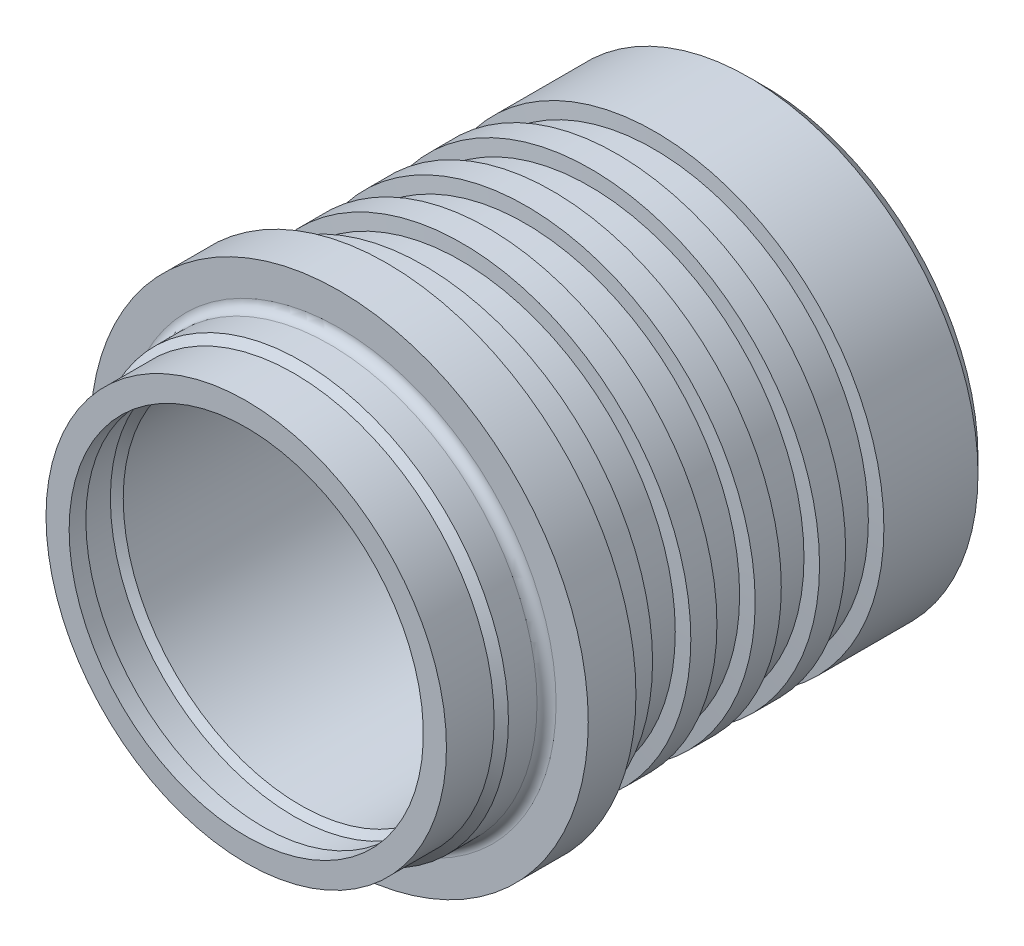
ISO-10303-21;
HEADER;
FILE_DESCRIPTION(('STEP AP214'),'2;1');
FILE_NAME('part.step','',(''),(''),'','','');
FILE_SCHEMA(('AUTOMOTIVE_DESIGN { 1 0 10303 214 1 1 1 1 }'));
ENDSEC;
DATA;
#1=APPLICATION_CONTEXT('core data for automotive mechanical design processes');
#2=APPLICATION_PROTOCOL_DEFINITION('international standard','automotive_design',2000,#1);
#3=PRODUCT_CONTEXT('',#1,'mechanical');
#4=PRODUCT('Part','Part','',(#3));
#5=PRODUCT_RELATED_PRODUCT_CATEGORY('part','',(#4));
#6=PRODUCT_DEFINITION_FORMATION('','',#4);
#7=PRODUCT_DEFINITION_CONTEXT('part definition',#1,'design');
#8=PRODUCT_DEFINITION('design','',#6,#7);
#9=PRODUCT_DEFINITION_SHAPE('','',#8);
#10=(LENGTH_UNIT() NAMED_UNIT(*) SI_UNIT(.MILLI.,.METRE.));
#11=(NAMED_UNIT(*) PLANE_ANGLE_UNIT() SI_UNIT($,.RADIAN.));
#12=(NAMED_UNIT(*) SI_UNIT($,.STERADIAN.) SOLID_ANGLE_UNIT());
#13=UNCERTAINTY_MEASURE_WITH_UNIT(LENGTH_MEASURE(1.E-05),#10,'distance_accuracy_value','');
#14=(GEOMETRIC_REPRESENTATION_CONTEXT(3) GLOBAL_UNCERTAINTY_ASSIGNED_CONTEXT((#13)) GLOBAL_UNIT_ASSIGNED_CONTEXT((#10,
#11,#12)) REPRESENTATION_CONTEXT('',''));
#15=CARTESIAN_POINT('',(0.,0.,0.));
#16=DIRECTION('',(0.,0.,1.));
#17=DIRECTION('',(1.,0.,0.));
#18=AXIS2_PLACEMENT_3D('',#15,#16,#17);
#19=CARTESIAN_POINT('',(0.,0.,-9.8425));
#20=DIRECTION('',(0.,0.,1.));
#21=DIRECTION('',(1.,0.,0.));
#22=AXIS2_PLACEMENT_3D('',#19,#20,#21);
#23=CYLINDRICAL_SURFACE('',#22,4.5);
#24=CARTESIAN_POINT('',(0.,0.,-3.55000000000416));
#25=DIRECTION('',(0.,0.,1.));
#26=DIRECTION('',(1.,0.,0.));
#27=AXIS2_PLACEMENT_3D('',#24,#25,#26);
#28=CIRCLE('',#27,4.50000000000728);
#29=CARTESIAN_POINT('',(4.50000000000728,0.,-3.55000000000416));
#30=VERTEX_POINT('',#29);
#31=EDGE_CURVE('E332',#30,#30,#28,.T.);
#32=ORIENTED_EDGE('',*,*,#31,.F.);
#33=EDGE_LOOP('',(#32));
#34=FACE_BOUND('',#33,.T.);
#35=CARTESIAN_POINT('',(0.,0.,-4.30000000000064));
#36=DIRECTION('',(0.,0.,-1.));
#37=DIRECTION('',(-1.,0.,0.));
#38=AXIS2_PLACEMENT_3D('',#35,#36,#37);
#39=CIRCLE('',#38,4.50000000000728);
#40=CARTESIAN_POINT('',(-4.50000000000728,0.,-4.30000000000064));
#41=VERTEX_POINT('',#40);
#42=EDGE_CURVE('E334',#41,#41,#39,.T.);
#43=ORIENTED_EDGE('',*,*,#42,.F.);
#44=EDGE_LOOP('',(#43));
#45=FACE_BOUND('',#44,.T.);
#46=ADVANCED_FACE('F17',(#34,#45),#23,.T.);
#47=CARTESIAN_POINT('',(0.,0.,-4.32624659904945));
#48=DIRECTION('',(0.,0.,-1.));
#49=DIRECTION('',(-1.,0.,0.));
#50=AXIS2_PLACEMENT_3D('',#47,#48,#49);
#51=CONICAL_SURFACE('',#50,4.79999999987513,1.48352986417246);
#52=ORIENTED_EDGE('',*,*,#42,.T.);
#53=EDGE_LOOP('',(#52));
#54=FACE_BOUND('',#53,.T.);
#55=CARTESIAN_POINT('',(0.,0.,-4.326246599058));
#56=DIRECTION('',(0.,0.,1.));
#57=DIRECTION('',(1.,0.,0.));
#58=AXIS2_PLACEMENT_3D('',#55,#56,#57);
#59=CIRCLE('',#58,4.8);
#60=CARTESIAN_POINT('',(4.8,0.,-4.326246599058));
#61=VERTEX_POINT('',#60);
#62=EDGE_CURVE('E329',#61,#61,#59,.F.);
#63=ORIENTED_EDGE('',*,*,#62,.F.);
#64=EDGE_LOOP('',(#63));
#65=FACE_BOUND('',#64,.T.);
#66=ADVANCED_FACE('F338',(#54,#65),#51,.T.);
#67=CARTESIAN_POINT('',(0.,0.,-3.52375340095534));
#68=DIRECTION('',(0.,0.,1.));
#69=DIRECTION('',(1.,0.,0.));
#70=AXIS2_PLACEMENT_3D('',#67,#68,#69);
#71=CONICAL_SURFACE('',#70,4.79999999987513,1.48352986419597);
#72=CARTESIAN_POINT('',(0.,0.,-3.523753400942));
#73=DIRECTION('',(0.,0.,1.));
#74=DIRECTION('',(1.,0.,0.));
#75=AXIS2_PLACEMENT_3D('',#72,#73,#74);
#76=CIRCLE('',#75,4.8);
#77=CARTESIAN_POINT('',(4.8,0.,-3.523753400942));
#78=VERTEX_POINT('',#77);
#79=EDGE_CURVE('E326',#78,#78,#76,.T.);
#80=ORIENTED_EDGE('',*,*,#79,.F.);
#81=EDGE_LOOP('',(#80));
#82=FACE_BOUND('',#81,.T.);
#83=ORIENTED_EDGE('',*,*,#31,.T.);
#84=EDGE_LOOP('',(#83));
#85=FACE_BOUND('',#84,.T.);
#86=ADVANCED_FACE('F346',(#82,#85),#71,.T.);
#87=CARTESIAN_POINT('',(0.,0.,-9.8425));
#88=DIRECTION('',(0.,0.,1.));
#89=DIRECTION('',(1.,0.,0.));
#90=AXIS2_PLACEMENT_3D('',#87,#88,#89);
#91=CYLINDRICAL_SURFACE('',#90,4.8);
#92=ORIENTED_EDGE('',*,*,#62,.T.);
#93=EDGE_LOOP('',(#92));
#94=FACE_BOUND('',#93,.T.);
#95=CARTESIAN_POINT('',(0.,0.,-4.87375340094331));
#96=DIRECTION('',(0.,0.,1.));
#97=DIRECTION('',(1.,0.,0.));
#98=AXIS2_PLACEMENT_3D('',#95,#96,#97);
#99=CIRCLE('',#98,4.79999999998881);
#100=CARTESIAN_POINT('',(4.79999999998881,0.,-4.87375340094331));
#101=VERTEX_POINT('',#100);
#102=EDGE_CURVE('E323',#101,#101,#99,.F.);
#103=ORIENTED_EDGE('',*,*,#102,.F.);
#104=EDGE_LOOP('',(#103));
#105=FACE_BOUND('',#104,.T.);
#106=ADVANCED_FACE('F350',(#94,#105),#91,.T.);
#107=CARTESIAN_POINT('',(0.,0.,-9.8425));
#108=DIRECTION('',(0.,0.,1.));
#109=DIRECTION('',(1.,0.,0.));
#110=AXIS2_PLACEMENT_3D('',#107,#108,#109);
#111=CYLINDRICAL_SURFACE('',#110,4.8);
#112=CARTESIAN_POINT('',(0.,0.,-2.97624659905438));
#113=DIRECTION('',(0.,0.,-1.));
#114=DIRECTION('',(-1.,0.,0.));
#115=AXIS2_PLACEMENT_3D('',#112,#113,#114);
#116=CIRCLE('',#115,4.79999999998881);
#117=CARTESIAN_POINT('',(-4.79999999998881,0.,-2.97624659905438));
#118=VERTEX_POINT('',#117);
#119=EDGE_CURVE('E320',#118,#118,#116,.F.);
#120=ORIENTED_EDGE('',*,*,#119,.F.);
#121=EDGE_LOOP('',(#120));
#122=FACE_BOUND('',#121,.T.);
#123=ORIENTED_EDGE('',*,*,#79,.T.);
#124=EDGE_LOOP('',(#123));
#125=FACE_BOUND('',#124,.T.);
#126=ADVANCED_FACE('F356',(#122,#125),#111,.T.);
#127=CARTESIAN_POINT('',(0.,0.,-4.87375340095042));
#128=DIRECTION('',(0.,0.,1.));
#129=DIRECTION('',(1.,0.,0.));
#130=AXIS2_PLACEMENT_3D('',#127,#128,#129);
#131=CONICAL_SURFACE('',#130,4.79999999987513,1.48352986417246);
#132=ORIENTED_EDGE('',*,*,#102,.T.);
#133=EDGE_LOOP('',(#132));
#134=FACE_BOUND('',#133,.T.);
#135=CARTESIAN_POINT('',(0.,0.,-4.9));
#136=DIRECTION('',(0.,0.,1.));
#137=DIRECTION('',(1.,0.,0.));
#138=AXIS2_PLACEMENT_3D('',#135,#136,#137);
#139=CIRCLE('',#138,4.5);
#140=CARTESIAN_POINT('',(4.5,0.,-4.9));
#141=VERTEX_POINT('',#140);
#142=EDGE_CURVE('E317',#141,#141,#139,.F.);
#143=ORIENTED_EDGE('',*,*,#142,.F.);
#144=EDGE_LOOP('',(#143));
#145=FACE_BOUND('',#144,.T.);
#146=ADVANCED_FACE('F363',(#134,#145),#131,.T.);
#147=CARTESIAN_POINT('',(0.,0.,-2.97624659904727));
#148=DIRECTION('',(0.,0.,-1.));
#149=DIRECTION('',(0.,1.,0.));
#150=AXIS2_PLACEMENT_3D('',#147,#148,#149);
#151=CONICAL_SURFACE('',#150,4.79999999987513,1.48352986419597);
#152=CARTESIAN_POINT('',(0.,0.,-2.95));
#153=DIRECTION('',(0.,0.,1.));
#154=DIRECTION('',(1.,0.,0.));
#155=AXIS2_PLACEMENT_3D('',#152,#153,#154);
#156=CIRCLE('',#155,4.5);
#157=CARTESIAN_POINT('',(4.5,0.,-2.95));
#158=VERTEX_POINT('',#157);
#159=EDGE_CURVE('E314',#158,#158,#156,.T.);
#160=ORIENTED_EDGE('',*,*,#159,.F.);
#161=EDGE_LOOP('',(#160));
#162=FACE_BOUND('',#161,.T.);
#163=ORIENTED_EDGE('',*,*,#119,.T.);
#164=EDGE_LOOP('',(#163));
#165=FACE_BOUND('',#164,.T.);
#166=ADVANCED_FACE('F367',(#162,#165),#151,.T.);
#167=CARTESIAN_POINT('',(0.,0.,-9.8425));
#168=DIRECTION('',(0.,0.,1.));
#169=DIRECTION('',(1.,0.,0.));
#170=AXIS2_PLACEMENT_3D('',#167,#168,#169);
#171=CYLINDRICAL_SURFACE('',#170,4.5);
#172=ORIENTED_EDGE('',*,*,#142,.T.);
#173=EDGE_LOOP('',(#172));
#174=FACE_BOUND('',#173,.T.);
#175=CARTESIAN_POINT('',(0.,0.,-5.64999999999571));
#176=DIRECTION('',(0.,0.,-1.));
#177=DIRECTION('',(-1.,0.,0.));
#178=AXIS2_PLACEMENT_3D('',#175,#176,#177);
#179=CIRCLE('',#178,4.50000000000728);
#180=CARTESIAN_POINT('',(-4.50000000000728,0.,-5.64999999999571));
#181=VERTEX_POINT('',#180);
#182=EDGE_CURVE('E311',#181,#181,#179,.T.);
#183=ORIENTED_EDGE('',*,*,#182,.F.);
#184=EDGE_LOOP('',(#183));
#185=FACE_BOUND('',#184,.T.);
#186=ADVANCED_FACE('F371',(#174,#185),#171,.T.);
#187=CARTESIAN_POINT('',(0.,0.,-9.8425));
#188=DIRECTION('',(0.,0.,1.));
#189=DIRECTION('',(1.,0.,0.));
#190=AXIS2_PLACEMENT_3D('',#187,#188,#189);
#191=CYLINDRICAL_SURFACE('',#190,4.5);
#192=CARTESIAN_POINT('',(0.,0.,-2.20000000000198));
#193=DIRECTION('',(0.,0.,1.));
#194=DIRECTION('',(1.,0.,0.));
#195=AXIS2_PLACEMENT_3D('',#192,#193,#194);
#196=CIRCLE('',#195,4.50000000000728);
#197=CARTESIAN_POINT('',(4.50000000000728,0.,-2.20000000000198));
#198=VERTEX_POINT('',#197);
#199=EDGE_CURVE('E308',#198,#198,#196,.T.);
#200=ORIENTED_EDGE('',*,*,#199,.F.);
#201=EDGE_LOOP('',(#200));
#202=FACE_BOUND('',#201,.T.);
#203=ORIENTED_EDGE('',*,*,#159,.T.);
#204=EDGE_LOOP('',(#203));
#205=FACE_BOUND('',#204,.T.);
#206=ADVANCED_FACE('F375',(#202,#205),#191,.T.);
#207=CARTESIAN_POINT('',(0.,0.,-5.67624659904453));
#208=DIRECTION('',(0.,0.,-1.));
#209=DIRECTION('',(-1.,0.,0.));
#210=AXIS2_PLACEMENT_3D('',#207,#208,#209);
#211=CONICAL_SURFACE('',#210,4.79999999987513,1.48352986417246);
#212=ORIENTED_EDGE('',*,*,#182,.T.);
#213=EDGE_LOOP('',(#212));
#214=FACE_BOUND('',#213,.T.);
#215=CARTESIAN_POINT('',(0.,0.,-5.676246599058));
#216=DIRECTION('',(0.,0.,1.));
#217=DIRECTION('',(1.,0.,0.));
#218=AXIS2_PLACEMENT_3D('',#215,#216,#217);
#219=CIRCLE('',#218,4.8);
#220=CARTESIAN_POINT('',(4.8,0.,-5.676246599058));
#221=VERTEX_POINT('',#220);
#222=EDGE_CURVE('E303',#221,#221,#219,.F.);
#223=ORIENTED_EDGE('',*,*,#222,.F.);
#224=EDGE_LOOP('',(#223));
#225=FACE_BOUND('',#224,.T.);
#226=ADVANCED_FACE('F379',(#214,#225),#211,.T.);
#227=CARTESIAN_POINT('',(0.,0.,-2.17375340095316));
#228=DIRECTION('',(0.,0.,1.));
#229=DIRECTION('',(1.,0.,0.));
#230=AXIS2_PLACEMENT_3D('',#227,#228,#229);
#231=CONICAL_SURFACE('',#230,4.79999999987513,1.48352986419597);
#232=CARTESIAN_POINT('',(0.,0.,-2.173753400942));
#233=DIRECTION('',(0.,0.,1.));
#234=DIRECTION('',(1.,0.,0.));
#235=AXIS2_PLACEMENT_3D('',#232,#233,#234);
#236=CIRCLE('',#235,4.8);
#237=CARTESIAN_POINT('',(4.8,0.,-2.173753400942));
#238=VERTEX_POINT('',#237);
#239=EDGE_CURVE('E298',#238,#238,#236,.T.);
#240=ORIENTED_EDGE('',*,*,#239,.F.);
#241=EDGE_LOOP('',(#240));
#242=FACE_BOUND('',#241,.T.);
#243=ORIENTED_EDGE('',*,*,#199,.T.);
#244=EDGE_LOOP('',(#243));
#245=FACE_BOUND('',#244,.T.);
#246=ADVANCED_FACE('F383',(#242,#245),#231,.T.);
#247=CARTESIAN_POINT('',(0.,0.,-9.8425));
#248=DIRECTION('',(0.,0.,1.));
#249=DIRECTION('',(1.,0.,0.));
#250=AXIS2_PLACEMENT_3D('',#247,#248,#249);
#251=CYLINDRICAL_SURFACE('',#250,4.8);
#252=ORIENTED_EDGE('',*,*,#222,.T.);
#253=EDGE_LOOP('',(#252));
#254=FACE_BOUND('',#253,.T.);
#255=CARTESIAN_POINT('',(0.,0.,-6.2237534009455));
#256=DIRECTION('',(0.,0.,1.));
#257=DIRECTION('',(1.,0.,0.));
#258=AXIS2_PLACEMENT_3D('',#255,#256,#257);
#259=CIRCLE('',#258,4.79999999998881);
#260=CARTESIAN_POINT('',(4.79999999998881,0.,-6.2237534009455));
#261=VERTEX_POINT('',#260);
#262=EDGE_CURVE('E285',#261,#261,#259,.F.);
#263=ORIENTED_EDGE('',*,*,#262,.F.);
#264=EDGE_LOOP('',(#263));
#265=FACE_BOUND('',#264,.T.);
#266=ADVANCED_FACE('F387',(#254,#265),#251,.T.);
#267=CARTESIAN_POINT('',(0.,0.,-9.8425));
#268=DIRECTION('',(0.,0.,1.));
#269=DIRECTION('',(1.,0.,0.));
#270=AXIS2_PLACEMENT_3D('',#267,#268,#269);
#271=CYLINDRICAL_SURFACE('',#270,4.8);
#272=CARTESIAN_POINT('',(0.,0.,-1.4));
#273=DIRECTION('',(0.,0.,1.));
#274=DIRECTION('',(1.,0.,0.));
#275=AXIS2_PLACEMENT_3D('',#272,#273,#274);
#276=CIRCLE('',#275,4.8);
#277=CARTESIAN_POINT('',(4.8,0.,-1.4));
#278=VERTEX_POINT('',#277);
#279=EDGE_CURVE('E282',#278,#278,#276,.F.);
#280=ORIENTED_EDGE('',*,*,#279,.T.);
#281=EDGE_LOOP('',(#280));
#282=FACE_BOUND('',#281,.T.);
#283=ORIENTED_EDGE('',*,*,#239,.T.);
#284=EDGE_LOOP('',(#283));
#285=FACE_BOUND('',#284,.T.);
#286=ADVANCED_FACE('F391',(#282,#285),#271,.T.);
#287=CARTESIAN_POINT('',(0.,0.,-6.2237534009526));
#288=DIRECTION('',(0.,0.,1.));
#289=DIRECTION('',(1.,0.,0.));
#290=AXIS2_PLACEMENT_3D('',#287,#288,#289);
#291=CONICAL_SURFACE('',#290,4.79999999987513,1.48352986417246);
#292=ORIENTED_EDGE('',*,*,#262,.T.);
#293=EDGE_LOOP('',(#292));
#294=FACE_BOUND('',#293,.T.);
#295=CARTESIAN_POINT('',(0.,0.,-6.25));
#296=DIRECTION('',(0.,0.,1.));
#297=DIRECTION('',(1.,0.,0.));
#298=AXIS2_PLACEMENT_3D('',#295,#296,#297);
#299=CIRCLE('',#298,4.5);
#300=CARTESIAN_POINT('',(4.5,0.,-6.25));
#301=VERTEX_POINT('',#300);
#302=EDGE_CURVE('E281',#301,#301,#299,.F.);
#303=ORIENTED_EDGE('',*,*,#302,.F.);
#304=EDGE_LOOP('',(#303));
#305=FACE_BOUND('',#304,.T.);
#306=ADVANCED_FACE('F395',(#294,#305),#291,.T.);
#307=CARTESIAN_POINT('',(0.,0.,-1.4));
#308=DIRECTION('',(0.,0.,1.));
#309=DIRECTION('',(1.,0.,0.));
#310=AXIS2_PLACEMENT_3D('',#307,#308,#309);
#311=PLANE('',#310);
#312=ORIENTED_EDGE('',*,*,#279,.F.);
#313=EDGE_LOOP('',(#312));
#314=FACE_BOUND('',#313,.T.);
#315=CARTESIAN_POINT('',(0.,0.,-1.4));
#316=DIRECTION('',(0.,0.,1.));
#317=DIRECTION('',(1.,0.,0.));
#318=AXIS2_PLACEMENT_3D('',#315,#316,#317);
#319=CIRCLE('',#318,5.225);
#320=CARTESIAN_POINT('',(5.225,0.,-1.4));
#321=VERTEX_POINT('',#320);
#322=EDGE_CURVE('E278',#321,#321,#319,.T.);
#323=ORIENTED_EDGE('',*,*,#322,.F.);
#324=EDGE_LOOP('',(#323));
#325=FACE_BOUND('',#324,.T.);
#326=ADVANCED_FACE('F398',(#314,#325),#311,.F.);
#327=CARTESIAN_POINT('',(0.,0.,-9.8425));
#328=DIRECTION('',(0.,0.,1.));
#329=DIRECTION('',(1.,0.,0.));
#330=AXIS2_PLACEMENT_3D('',#327,#328,#329);
#331=CYLINDRICAL_SURFACE('',#330,4.5);
#332=ORIENTED_EDGE('',*,*,#302,.T.);
#333=EDGE_LOOP('',(#332));
#334=FACE_BOUND('',#333,.T.);
#335=CARTESIAN_POINT('',(0.,0.,-6.9999999999979));
#336=DIRECTION('',(0.,0.,-1.));
#337=DIRECTION('',(-1.,0.,0.));
#338=AXIS2_PLACEMENT_3D('',#335,#336,#337);
#339=CIRCLE('',#338,4.50000000000728);
#340=CARTESIAN_POINT('',(-4.50000000000728,0.,-6.9999999999979));
#341=VERTEX_POINT('',#340);
#342=EDGE_CURVE('E277',#341,#341,#339,.T.);
#343=ORIENTED_EDGE('',*,*,#342,.F.);
#344=EDGE_LOOP('',(#343));
#345=FACE_BOUND('',#344,.T.);
#346=ADVANCED_FACE('F401',(#334,#345),#331,.T.);
#347=CARTESIAN_POINT('',(0.,0.,-9.8425));
#348=DIRECTION('',(0.,0.,1.));
#349=DIRECTION('',(1.,0.,0.));
#350=AXIS2_PLACEMENT_3D('',#347,#348,#349);
#351=CYLINDRICAL_SURFACE('',#350,5.225);
#352=ORIENTED_EDGE('',*,*,#322,.T.);
#353=EDGE_LOOP('',(#352));
#354=FACE_BOUND('',#353,.T.);
#355=CARTESIAN_POINT('',(0.,0.,-0.399999999999999));
#356=DIRECTION('',(0.,0.,1.));
#357=DIRECTION('',(1.,0.,0.));
#358=AXIS2_PLACEMENT_3D('',#355,#356,#357);
#359=CIRCLE('',#358,5.225);
#360=CARTESIAN_POINT('',(5.225,0.,-0.399999999999999));
#361=VERTEX_POINT('',#360);
#362=EDGE_CURVE('E274',#361,#361,#359,.T.);
#363=ORIENTED_EDGE('',*,*,#362,.F.);
#364=EDGE_LOOP('',(#363));
#365=FACE_BOUND('',#364,.T.);
#366=ADVANCED_FACE('F404',(#354,#365),#351,.T.);
#367=CARTESIAN_POINT('',(0.,0.,-7.02624659904671));
#368=DIRECTION('',(0.,0.,-1.));
#369=DIRECTION('',(-1.,0.,0.));
#370=AXIS2_PLACEMENT_3D('',#367,#368,#369);
#371=CONICAL_SURFACE('',#370,4.79999999987513,1.48352986417246);
#372=ORIENTED_EDGE('',*,*,#342,.T.);
#373=EDGE_LOOP('',(#372));
#374=FACE_BOUND('',#373,.T.);
#375=CARTESIAN_POINT('',(0.,0.,-7.026246599058));
#376=DIRECTION('',(0.,0.,1.));
#377=DIRECTION('',(1.,0.,0.));
#378=AXIS2_PLACEMENT_3D('',#375,#376,#377);
#379=CIRCLE('',#378,4.8);
#380=CARTESIAN_POINT('',(4.8,0.,-7.026246599058));
#381=VERTEX_POINT('',#380);
#382=EDGE_CURVE('E59',#381,#381,#379,.F.);
#383=ORIENTED_EDGE('',*,*,#382,.F.);
#384=EDGE_LOOP('',(#383));
#385=FACE_BOUND('',#384,.T.);
#386=ADVANCED_FACE('F82',(#374,#385),#371,.T.);
#387=CARTESIAN_POINT('',(0.,0.,-0.4));
#388=DIRECTION('',(0.,0.,1.));
#389=DIRECTION('',(1.,0.,0.));
#390=AXIS2_PLACEMENT_3D('',#387,#388,#389);
#391=PLANE('',#390);
#392=CARTESIAN_POINT('',(0.,0.,-0.4));
#393=DIRECTION('',(0.,0.,1.));
#394=DIRECTION('',(1.,0.,0.));
#395=AXIS2_PLACEMENT_3D('',#392,#393,#394);
#396=CIRCLE('',#395,4.55);
#397=CARTESIAN_POINT('',(-4.55,0.,-0.4));
#398=VERTEX_POINT('',#397);
#399=CARTESIAN_POINT('',(4.55,0.,-0.4));
#400=VERTEX_POINT('',#399);
#401=EDGE_CURVE('E57',#398,#400,#396,.F.);
#402=ORIENTED_EDGE('',*,*,#401,.T.);
#403=CARTESIAN_POINT('',(0.,0.,-0.4));
#404=DIRECTION('',(0.,0.,1.));
#405=DIRECTION('',(-1.,0.,0.));
#406=AXIS2_PLACEMENT_3D('',#403,#404,#405);
#407=CIRCLE('',#406,4.55);
#408=EDGE_CURVE('E51',#400,#398,#407,.F.);
#409=ORIENTED_EDGE('',*,*,#408,.T.);
#410=EDGE_LOOP('',(#402,#409));
#411=FACE_BOUND('',#410,.T.);
#412=ORIENTED_EDGE('',*,*,#362,.T.);
#413=EDGE_LOOP('',(#412));
#414=FACE_BOUND('',#413,.T.);
#415=ADVANCED_FACE('F62',(#411,#414),#391,.T.);
#416=CARTESIAN_POINT('',(0.,0.,-9.8425));
#417=DIRECTION('',(0.,0.,1.));
#418=DIRECTION('',(1.,0.,0.));
#419=AXIS2_PLACEMENT_3D('',#416,#417,#418);
#420=CYLINDRICAL_SURFACE('',#419,4.8);
#421=ORIENTED_EDGE('',*,*,#382,.T.);
#422=EDGE_LOOP('',(#421));
#423=FACE_BOUND('',#422,.T.);
#424=CARTESIAN_POINT('',(0.,0.,-9.00000000001455));
#425=DIRECTION('',(0.,0.,1.));
#426=DIRECTION('',(1.,0.,0.));
#427=AXIS2_PLACEMENT_3D('',#424,#425,#426);
#428=CIRCLE('',#427,4.79999999998881);
#429=CARTESIAN_POINT('',(4.79999999998881,0.,-9.00000000001455));
#430=VERTEX_POINT('',#429);
#431=EDGE_CURVE('E64',#430,#430,#428,.F.);
#432=ORIENTED_EDGE('',*,*,#431,.F.);
#433=EDGE_LOOP('',(#432));
#434=FACE_BOUND('',#433,.T.);
#435=ADVANCED_FACE('F81',(#423,#434),#420,.T.);
#436=CARTESIAN_POINT('',(0.,0.,-0.2));
#437=DIRECTION('',(0.,0.,1.));
#438=DIRECTION('',(1.,0.,0.));
#439=AXIS2_PLACEMENT_3D('',#436,#437,#438);
#440=TOROIDAL_SURFACE('',#439,4.55,0.2);
#441=ORIENTED_EDGE('',*,*,#401,.F.);
#442=ORIENTED_EDGE('',*,*,#408,.F.);
#443=EDGE_LOOP('',(#441,#442));
#444=FACE_BOUND('',#443,.T.);
#445=CARTESIAN_POINT('',(0.,0.,-0.200000000000001));
#446=DIRECTION('',(0.,0.,1.));
#447=DIRECTION('',(1.,0.,0.));
#448=AXIS2_PLACEMENT_3D('',#445,#446,#447);
#449=CIRCLE('',#448,4.35);
#450=CARTESIAN_POINT('',(4.35,0.,-0.200000000000001));
#451=VERTEX_POINT('',#450);
#452=EDGE_CURVE('E110',#451,#451,#449,.T.);
#453=ORIENTED_EDGE('',*,*,#452,.F.);
#454=EDGE_LOOP('',(#453));
#455=FACE_BOUND('',#454,.T.);
#456=ADVANCED_FACE('F55',(#444,#455),#440,.F.);
#457=CARTESIAN_POINT('',(0.,0.,-9.00000000012824));
#458=DIRECTION('',(0.,0.,1.));
#459=DIRECTION('',(1.,0.,0.));
#460=AXIS2_PLACEMENT_3D('',#457,#458,#459);
#461=CONICAL_SURFACE('',#460,4.79999999987513,0.785398163397448);
#462=ORIENTED_EDGE('',*,*,#431,.T.);
#463=EDGE_LOOP('',(#462));
#464=FACE_BOUND('',#463,.T.);
#465=CARTESIAN_POINT('',(0.,0.,-9.29999999999609));
#466=DIRECTION('',(0.,0.,1.));
#467=DIRECTION('',(1.,0.,0.));
#468=AXIS2_PLACEMENT_3D('',#465,#466,#467);
#469=CIRCLE('',#468,4.50000000000728);
#470=CARTESIAN_POINT('',(4.50000000000728,0.,-9.29999999999609));
#471=VERTEX_POINT('',#470);
#472=EDGE_CURVE('E113',#471,#471,#469,.T.);
#473=ORIENTED_EDGE('',*,*,#472,.T.);
#474=EDGE_LOOP('',(#473));
#475=FACE_BOUND('',#474,.T.);
#476=ADVANCED_FACE('F105',(#464,#475),#461,.T.);
#477=CARTESIAN_POINT('',(0.,0.,-9.8425));
#478=DIRECTION('',(0.,0.,1.));
#479=DIRECTION('',(1.,0.,0.));
#480=AXIS2_PLACEMENT_3D('',#477,#478,#479);
#481=CYLINDRICAL_SURFACE('',#480,4.35);
#482=ORIENTED_EDGE('',*,*,#452,.T.);
#483=EDGE_LOOP('',(#482));
#484=FACE_BOUND('',#483,.T.);
#485=CARTESIAN_POINT('',(0.,0.,0.399999999956435));
#486=DIRECTION('',(0.,0.,-1.));
#487=DIRECTION('',(-1.,0.,0.));
#488=AXIS2_PLACEMENT_3D('',#485,#486,#487);
#489=CIRCLE('',#488,4.34999999998809);
#490=CARTESIAN_POINT('',(-4.34999999998809,0.,0.399999999956435));
#491=VERTEX_POINT('',#490);
#492=EDGE_CURVE('E114',#491,#491,#489,.F.);
#493=ORIENTED_EDGE('',*,*,#492,.F.);
#494=EDGE_LOOP('',(#493));
#495=FACE_BOUND('',#494,.T.);
#496=ADVANCED_FACE('F208',(#484,#495),#481,.T.);
#497=CARTESIAN_POINT('',(0.,0.,-9.3));
#498=DIRECTION('',(0.,0.,1.));
#499=DIRECTION('',(1.,0.,0.));
#500=AXIS2_PLACEMENT_3D('',#497,#498,#499);
#501=PLANE('',#500);
#502=CARTESIAN_POINT('',(0.,0.,-9.29999999999609));
#503=DIRECTION('',(0.,0.,-1.));
#504=DIRECTION('',(-1.,0.,0.));
#505=AXIS2_PLACEMENT_3D('',#502,#503,#504);
#506=CIRCLE('',#505,3.12500000001137);
#507=CARTESIAN_POINT('',(-3.12500000001137,0.,-9.29999999999609));
#508=VERTEX_POINT('',#507);
#509=EDGE_CURVE('E117',#508,#508,#506,.F.);
#510=ORIENTED_EDGE('',*,*,#509,.T.);
#511=EDGE_LOOP('',(#510));
#512=FACE_BOUND('',#511,.T.);
#513=ORIENTED_EDGE('',*,*,#472,.F.);
#514=EDGE_LOOP('',(#513));
#515=FACE_BOUND('',#514,.T.);
#516=ADVANCED_FACE('F205',(#512,#515),#501,.F.);
#517=CARTESIAN_POINT('',(0.,0.,0.400000000013279));
#518=DIRECTION('',(0.,0.,-1.));
#519=DIRECTION('',(-1.,0.,0.));
#520=AXIS2_PLACEMENT_3D('',#517,#518,#519);
#521=CONICAL_SURFACE('',#520,4.34999999993124,0.785398163397448);
#522=ORIENTED_EDGE('',*,*,#492,.T.);
#523=EDGE_LOOP('',(#522));
#524=FACE_BOUND('',#523,.T.);
#525=CARTESIAN_POINT('',(0.,0.,0.55));
#526=DIRECTION('',(0.,0.,1.));
#527=DIRECTION('',(1.,0.,0.));
#528=AXIS2_PLACEMENT_3D('',#525,#526,#527);
#529=CIRCLE('',#528,4.2);
#530=CARTESIAN_POINT('',(4.2,0.,0.55));
#531=VERTEX_POINT('',#530);
#532=EDGE_CURVE('E118',#531,#531,#529,.T.);
#533=ORIENTED_EDGE('',*,*,#532,.F.);
#534=EDGE_LOOP('',(#533));
#535=FACE_BOUND('',#534,.T.);
#536=ADVANCED_FACE('F201',(#524,#535),#521,.T.);
#537=CARTESIAN_POINT('',(0.,0.,-9.29999999993925));
#538=DIRECTION('',(0.,0.,-1.));
#539=DIRECTION('',(-1.,0.,0.));
#540=AXIS2_PLACEMENT_3D('',#537,#538,#539);
#541=CONICAL_SURFACE('',#540,3.12499999995453,0.785398163397448);
#542=CARTESIAN_POINT('',(0.,0.,-9.));
#543=DIRECTION('',(0.,0.,-1.));
#544=DIRECTION('',(-1.,0.,0.));
#545=AXIS2_PLACEMENT_3D('',#542,#543,#544);
#546=CIRCLE('',#545,2.825);
#547=CARTESIAN_POINT('',(-2.825,0.,-9.));
#548=VERTEX_POINT('',#547);
#549=EDGE_CURVE('E121',#548,#548,#546,.F.);
#550=ORIENTED_EDGE('',*,*,#549,.T.);
#551=EDGE_LOOP('',(#550));
#552=FACE_BOUND('',#551,.T.);
#553=ORIENTED_EDGE('',*,*,#509,.F.);
#554=EDGE_LOOP('',(#553));
#555=FACE_BOUND('',#554,.T.);
#556=ADVANCED_FACE('F197',(#552,#555),#541,.F.);
#557=CARTESIAN_POINT('',(0.,0.,-9.8425));
#558=DIRECTION('',(0.,0.,1.));
#559=DIRECTION('',(1.,0.,0.));
#560=AXIS2_PLACEMENT_3D('',#557,#558,#559);
#561=CYLINDRICAL_SURFACE('',#560,4.2);
#562=ORIENTED_EDGE('',*,*,#532,.T.);
#563=EDGE_LOOP('',(#562));
#564=FACE_BOUND('',#563,.T.);
#565=CARTESIAN_POINT('',(0.,0.,1.55));
#566=DIRECTION('',(0.,0.,1.));
#567=DIRECTION('',(1.,0.,0.));
#568=AXIS2_PLACEMENT_3D('',#565,#566,#567);
#569=CIRCLE('',#568,4.2);
#570=CARTESIAN_POINT('',(4.2,0.,1.55));
#571=VERTEX_POINT('',#570);
#572=EDGE_CURVE('E124',#571,#571,#569,.T.);
#573=ORIENTED_EDGE('',*,*,#572,.F.);
#574=EDGE_LOOP('',(#573));
#575=FACE_BOUND('',#574,.T.);
#576=ADVANCED_FACE('F193',(#564,#575),#561,.T.);
#577=CARTESIAN_POINT('',(0.,0.,2.0925));
#578=DIRECTION('',(0.,0.,-1.));
#579=DIRECTION('',(-1.,0.,0.));
#580=AXIS2_PLACEMENT_3D('',#577,#578,#579);
#581=CYLINDRICAL_SURFACE('',#580,2.825);
#582=CARTESIAN_POINT('',(0.,0.,-7.5));
#583=DIRECTION('',(0.,0.,-1.));
#584=DIRECTION('',(-1.,0.,0.));
#585=AXIS2_PLACEMENT_3D('',#582,#583,#584);
#586=CIRCLE('',#585,2.825);
#587=CARTESIAN_POINT('',(-2.825,0.,-7.5));
#588=VERTEX_POINT('',#587);
#589=EDGE_CURVE('E265',#588,#588,#586,.F.);
#590=ORIENTED_EDGE('',*,*,#589,.T.);
#591=EDGE_LOOP('',(#590));
#592=FACE_BOUND('',#591,.T.);
#593=ORIENTED_EDGE('',*,*,#549,.F.);
#594=EDGE_LOOP('',(#593));
#595=FACE_BOUND('',#594,.T.);
#596=ADVANCED_FACE('F189',(#592,#595),#581,.F.);
#597=CARTESIAN_POINT('',(0.,0.,1.55));
#598=DIRECTION('',(0.,0.,1.));
#599=DIRECTION('',(1.,0.,0.));
#600=AXIS2_PLACEMENT_3D('',#597,#598,#599);
#601=PLANE('',#600);
#602=CARTESIAN_POINT('',(0.,0.,1.55));
#603=DIRECTION('',(0.,0.,-1.));
#604=DIRECTION('',(-1.,0.,0.));
#605=AXIS2_PLACEMENT_3D('',#602,#603,#604);
#606=CIRCLE('',#605,3.715);
#607=CARTESIAN_POINT('',(-3.715,0.,1.55));
#608=VERTEX_POINT('',#607);
#609=EDGE_CURVE('E260',#608,#608,#606,.T.);
#610=ORIENTED_EDGE('',*,*,#609,.T.);
#611=EDGE_LOOP('',(#610));
#612=FACE_BOUND('',#611,.T.);
#613=ORIENTED_EDGE('',*,*,#572,.T.);
#614=EDGE_LOOP('',(#613));
#615=FACE_BOUND('',#614,.T.);
#616=ADVANCED_FACE('F177',(#612,#615),#601,.T.);
#617=CARTESIAN_POINT('',(0.,0.,-7.5));
#618=DIRECTION('',(0.,0.,-1.));
#619=DIRECTION('',(-1.,0.,0.));
#620=AXIS2_PLACEMENT_3D('',#617,#618,#619);
#621=PLANE('',#620);
#622=ORIENTED_EDGE('',*,*,#589,.F.);
#623=EDGE_LOOP('',(#622));
#624=FACE_BOUND('',#623,.T.);
#625=DIRECTION('',(0.0165725341842814,0.999862666125059,0.));
#626=VECTOR('',#625,1.);
#627=CARTESIAN_POINT('',(-2.917264973081,8.61330998929224E-11,-7.5));
#628=LINE('',#627,#626);
#629=CARTESIAN_POINT('',(-2.91726497308112,3.44531152739191E-11,-7.5));
#630=VERTEX_POINT('',#629);
#631=CARTESIAN_POINT('',(-2.91566252591481,0.0966796676788339,-7.5));
#632=VERTEX_POINT('',#631);
#633=EDGE_CURVE('E258',#630,#632,#628,.T.);
#634=ORIENTED_EDGE('',*,*,#633,.F.);
#635=CARTESIAN_POINT('',(0.,0.,-7.5));
#636=DIRECTION('',(0.,0.,-1.));
#637=DIRECTION('',(0.9994507022224,-0.0331405163983859,0.));
#638=AXIS2_PLACEMENT_3D('',#635,#636,#637);
#639=CIRCLE('',#638,2.91726497308138);
#640=CARTESIAN_POINT('',(2.91566252591481,-0.0966796676788339,-7.5));
#641=VERTEX_POINT('',#640);
#642=EDGE_CURVE('E129',#641,#630,#639,.T.);
#643=ORIENTED_EDGE('',*,*,#642,.F.);
#644=DIRECTION('',(-0.0165725341695207,-0.999862666125303,0.));
#645=VECTOR('',#644,1.);
#646=CARTESIAN_POINT('',(2.917264973081,0.,-7.5));
#647=LINE('',#646,#645);
#648=CARTESIAN_POINT('',(2.91726497308108,0.,-7.5));
#649=VERTEX_POINT('',#648);
#650=EDGE_CURVE('E37',#649,#641,#647,.T.);
#651=ORIENTED_EDGE('',*,*,#650,.F.);
#652=CARTESIAN_POINT('',(-2.915662525915,0.0966796676788524,-7.5));
#653=CARTESIAN_POINT('',(-2.91456904277002,0.129663885000291,-7.5));
#654=CARTESIAN_POINT('',(-2.91291539186171,0.162629514256951,-7.5));
#655=CARTESIAN_POINT('',(-2.90849067395293,0.228485698393467,-7.5));
#656=CARTESIAN_POINT('',(-2.90571960695245,0.261376253273323,-7.5));
#657=CARTESIAN_POINT('',(-2.89906297629376,0.327044390408986,-7.5));
#658=CARTESIAN_POINT('',(-2.89517741263556,0.359821972664793,-7.5));
#659=CARTESIAN_POINT('',(-2.88629633670599,0.425226419693507,-7.5));
#660=CARTESIAN_POINT('',(-2.88130082443462,0.457853284466415,-7.50000000000001));
#661=CARTESIAN_POINT('',(-2.87020558438276,0.522918718601711,-7.49999999999999));
#662=CARTESIAN_POINT('',(-2.86410585660226,0.555357287964099,-7.49999999999996));
#663=CARTESIAN_POINT('',(-2.85080921837095,0.620008773530504,-7.50000000000004));
#664=CARTESIAN_POINT('',(-2.84361230792013,0.652221689734522,-7.50000000000014));
#665=CARTESIAN_POINT('',(-2.82812958202243,0.716384764488132,-7.49999999999986));
#666=CARTESIAN_POINT('',(-2.81984376657555,0.748334923037726,-7.49999999999946));
#667=CARTESIAN_POINT('',(-2.80219280958237,0.811935703812348,-7.50000000000054));
#668=CARTESIAN_POINT('',(-2.79282766803608,0.843586326037378,-7.50000000000202));
#669=CARTESIAN_POINT('',(-2.77302871104956,0.90655151426542,-7.49999999999798));
#670=CARTESIAN_POINT('',(-2.76259489560934,0.937866080268432,-7.49999999999247));
#671=CARTESIAN_POINT('',(-2.74067110568711,1.00012334479102,-7.50000000000753));
#672=CARTESIAN_POINT('',(-2.7291811312051,1.03106604331059,-7.50000000002809));
#673=CARTESIAN_POINT('',(-2.70515639674254,1.09254298968181,-7.49999999997191));
#674=CARTESIAN_POINT('',(-2.69262163676199,1.12307723753346,-7.49999999989516));
#675=CARTESIAN_POINT('',(-2.66545979986286,1.18618931574151,-7.50000000011343));
#676=CARTESIAN_POINT('',(-2.65074543927585,1.21872961258352,-7.50000000043943));
#677=CARTESIAN_POINT('',(-2.62015014647403,1.28324408092003,-7.50000000366755));
#678=CARTESIAN_POINT('',(-2.60426959058801,1.31521843094683,-7.50000000656885));
#679=CARTESIAN_POINT('',(-2.57136438404865,1.37856042964141,-7.50000005914296));
#680=CARTESIAN_POINT('',(-2.55434008655771,1.40992826177098,-7.50000010880139));
#681=CARTESIAN_POINT('',(-2.51476607135257,1.47976885037734,-7.50000023826759));
#682=CARTESIAN_POINT('',(-2.49189767772163,1.51806119938604,-7.50000032250664));
#683=CARTESIAN_POINT('',(-2.44449229732915,1.5935842350852,-7.50000101745765));
#684=CARTESIAN_POINT('',(-2.41995588900573,1.6308152835231,-7.50000162798795));
#685=CARTESIAN_POINT('',(-2.38674951415882,1.67860123322392,-7.50000195608533));
#686=CARTESIAN_POINT('',(-2.37889432376649,1.68972592653963,-7.50000199933658));
#687=CARTESIAN_POINT('',(-2.3573219593445,1.71979228717141,-7.50000198148768));
#688=CARTESIAN_POINT('',(-2.34344183121837,1.73861689977922,-7.50000182327654));
#689=CARTESIAN_POINT('',(-2.29273222606771,1.80567017896141,-7.50000124904142));
#690=CARTESIAN_POINT('',(-2.25459779770937,1.85292546043527,-7.50000082415865));
#691=CARTESIAN_POINT('',(-2.19179938227815,1.92595395506716,-7.50000035073353));
#692=CARTESIAN_POINT('',(-2.16807266562581,1.95254285876798,-7.50000021924007));
#693=CARTESIAN_POINT('',(-2.11849387569055,2.00610896272878,-7.50000005068469));
#694=CARTESIAN_POINT('',(-2.0925945228384,2.0330425887763,-7.5000000185053));
#695=CARTESIAN_POINT('',(-2.04800166526334,2.07770944143288,-7.49999999809396));
#696=CARTESIAN_POINT('',(-2.02956744315756,2.09570293875662,-7.49999999931947));
#697=CARTESIAN_POINT('',(-1.98601726833854,2.13713086138717,-7.50000000090747));
#698=CARTESIAN_POINT('',(-1.9607231067086,2.16037873120344,-7.50000000084591));
#699=CARTESIAN_POINT('',(-1.90932317525869,2.20595904283656,-7.50000000245611));
#700=CARTESIAN_POINT('',(-1.88321740062721,2.2282914792246,-7.50000000412788));
#701=CARTESIAN_POINT('',(-1.83023451280346,2.27202210641974,-7.50000000785221));
#702=CARTESIAN_POINT('',(-1.8033573954957,2.2934202922406,-7.50000000990477));
#703=CARTESIAN_POINT('',(-1.74886334050598,2.33525323682195,-7.50000001442228));
#704=CARTESIAN_POINT('',(-1.72124639931529,2.35568799101191,-7.50000001688724));
#705=CARTESIAN_POINT('',(-1.66530774383924,2.39556918539676,-7.50000002192822));
#706=CARTESIAN_POINT('',(-1.63698602662915,2.41501562148924,-7.50000002450426));
#707=CARTESIAN_POINT('',(-1.57967305046823,2.45289570049227,-7.50000002959328));
#708=CARTESIAN_POINT('',(-1.55068178913578,2.47132933979946,-7.50000003210627));
#709=CARTESIAN_POINT('',(-1.49206598061466,2.5071608342686,-7.50000003689897));
#710=CARTESIAN_POINT('',(-1.46244143154876,2.52455868635963,-7.50000003917869));
#711=CARTESIAN_POINT('',(-1.40259604558297,2.55829685114416,-7.50000004337153));
#712=CARTESIAN_POINT('',(-1.372375207269,2.57463716132937,-7.50000004528466));
#713=CARTESIAN_POINT('',(-1.31137500016842,2.60623982537641,-7.50000004863913));
#714=CARTESIAN_POINT('',(-1.28059563038838,2.62150217732074,-7.50000005008047));
#715=CARTESIAN_POINT('',(-1.21851681278009,2.65092985165371,-7.50000005241657));
#716=CARTESIAN_POINT('',(-1.18721736433513,2.66509517274141,-7.50000005331134));
#717=CARTESIAN_POINT('',(-1.1241374933144,2.692311085115,-7.50000005450935));
#718=CARTESIAN_POINT('',(-1.09235707045345,2.70536167573993,-7.50000005481259));
#719=CARTESIAN_POINT('',(-1.02835495584273,2.73033182063642,-7.50000005481259));
#720=CARTESIAN_POINT('',(-0.996133264092954,2.74225137490797,-7.50000005450934));
#721=CARTESIAN_POINT('',(-0.931288868899542,2.76494455505036,-7.50000005331134));
#722=CARTESIAN_POINT('',(-0.898666165693689,2.77571818160065,-7.50000005241658));
#723=CARTESIAN_POINT('',(-0.83306050625338,2.79610604726927,-7.50000005008046));
#724=CARTESIAN_POINT('',(-0.800077550446177,2.80572028776245,-7.50000004863911));
#725=CARTESIAN_POINT('',(-0.733792594955361,2.82377737227289,-7.50000004528469));
#726=CARTESIAN_POINT('',(-0.700490595839362,2.83222021837378,-7.50000004337162));
#727=CARTESIAN_POINT('',(-0.63360916173121,2.84792396970383,-7.5000000391786));
#728=CARTESIAN_POINT('',(-0.600029727397245,2.85518487773616,-7.50000003689864));
#729=CARTESIAN_POINT('',(-0.532635377799995,2.86851568772682,-7.5000000321066));
#730=CARTESIAN_POINT('',(-0.498820463235126,2.87458559321601,-7.50000002959452));
#731=CARTESIAN_POINT('',(-0.430997401876681,2.88552681841852,-7.50000002450302));
#732=CARTESIAN_POINT('',(-0.396989255770976,2.89039814239586,-7.50000002192359));
#733=CARTESIAN_POINT('',(-0.32882222341481,2.89893613863986,-7.50000001689187));
#734=CARTESIAN_POINT('',(-0.294663337790588,2.90260281590641,-7.50000001443957));
#735=CARTESIAN_POINT('',(-0.226237499285813,2.90872690403259,-7.50000000988748));
#736=CARTESIAN_POINT('',(-0.191970546918645,2.91118432062829,-7.50000000778768));
#737=CARTESIAN_POINT('',(-0.123371410240541,2.91488699137891,-7.50000000419241));
#738=CARTESIAN_POINT('',(-0.0890392262786874,2.91613225200242,-7.50000000269694));
#739=CARTESIAN_POINT('',(-0.0203524397707189,2.91740846053204,-7.50000000060508));
#740=CARTESIAN_POINT('',(0.01400216264126,2.9174394156383,-7.50000000000868));
#741=CARTESIAN_POINT('',(0.0812925167945955,2.91631266535306,-7.49999999999167));
#742=CARTESIAN_POINT('',(0.114229089485703,2.91520330284703,-7.50000000052418));
#743=CARTESIAN_POINT('',(0.18004545652824,2.91187264380614,-7.50000000145221));
#744=CARTESIAN_POINT('',(0.212925251840844,2.9096513662836,-7.50000000184773));
#745=CARTESIAN_POINT('',(0.278590508581233,2.9040988824802,-7.50000000203715));
#746=CARTESIAN_POINT('',(0.311375971342805,2.90076769197118,-7.50000000183105));
#747=CARTESIAN_POINT('',(0.376815239457954,2.89299937740254,-7.50000000104366));
#748=CARTESIAN_POINT('',(0.409469046297773,2.88856226586321,-7.50000000046237));
#749=CARTESIAN_POINT('',(0.474607787105356,2.87858717270343,-7.49999999987323));
#750=CARTESIAN_POINT('',(0.507092722494713,2.87304920036569,-7.49999999986537));
#751=CARTESIAN_POINT('',(0.571856751670908,2.860878705025,-7.50000000203232));
#752=CARTESIAN_POINT('',(0.60413584659776,2.85424618808947,-7.50000000420711));
#753=CARTESIAN_POINT('',(0.668451293665043,2.83989431464132,-7.50000001322453));
#754=CARTESIAN_POINT('',(0.700487646449609,2.83217496101376,-7.50000002006714));
#755=CARTESIAN_POINT('',(0.764281603880116,2.81565774278476,-7.50000004098135));
#756=CARTESIAN_POINT('',(0.796039208460815,2.8068598779309,-7.50000005505295));
#757=CARTESIAN_POINT('',(0.852918238979269,2.79006360954318,-7.50000009194773));
#758=CARTESIAN_POINT('',(0.878096692409924,2.78225718532627,-7.50000011245796));
#759=CARTESIAN_POINT('',(0.943435860312787,2.76102350132417,-7.50000017331283));
#760=CARTESIAN_POINT('',(0.983423515166825,2.74705826798894,-7.50000021814312));
#761=CARTESIAN_POINT('',(1.05613824761027,2.71986722985035,-7.50000029700059));
#762=CARTESIAN_POINT('',(1.08896480819339,2.70690601010591,-7.5000003315831));
#763=CARTESIAN_POINT('',(1.15412539350366,2.67979789092259,-7.50000039540533));
#764=CARTESIAN_POINT('',(1.18645941734077,2.66565098934143,-7.50000042464503));
#765=CARTESIAN_POINT('',(1.25059116093023,2.636190278479,-7.50000047403658));
#766=CARTESIAN_POINT('',(1.28238888171752,2.62087647144992,-7.50000049418845));
#767=CARTESIAN_POINT('',(1.34540603685004,2.58910230223872,-7.50000052342316));
#768=CARTESIAN_POINT('',(1.37662547447123,2.57264194655431,-7.50000053250607));
#769=CARTESIAN_POINT('',(1.43844456844211,2.53859655673875,-7.50000053866452));
#770=CARTESIAN_POINT('',(1.46904423061708,2.52101153318484,-7.50000053574017));
#771=CARTESIAN_POINT('',(1.52958318323023,2.48474018502099,-7.50000051818224));
#772=CARTESIAN_POINT('',(1.55952248234044,2.46605387488519,-7.50000050354881));
#773=CARTESIAN_POINT('',(1.61870098708641,2.42760480522095,-7.50000046405376));
#774=CARTESIAN_POINT('',(1.64794020452888,2.4078420638647,-7.50000043919231));
#775=CARTESIAN_POINT('',(1.70567974526544,2.36726639798535,-7.50000038192596));
#776=CARTESIAN_POINT('',(1.7341800837782,2.34645349511847,-7.50000034952121));
#777=CARTESIAN_POINT('',(1.79040413277917,2.30380525155213,-7.50000028102714));
#778=CARTESIAN_POINT('',(1.81812786216153,2.28196993576156,-7.5000002449379));
#779=CARTESIAN_POINT('',(1.87276170239833,2.23730568002647,-7.5000001742055));
#780=CARTESIAN_POINT('',(1.89967183608313,2.21447676800724,-7.50000013956229));
#781=CARTESIAN_POINT('',(1.95264368951089,2.16785655668386,-7.50000007776342));
#782=CARTESIAN_POINT('',(1.97870543622678,2.14406528803013,-7.50000005060753));
#783=CARTESIAN_POINT('',(2.02994272753434,2.0955487804804,-7.50000001208179));
#784=CARTESIAN_POINT('',(2.0551183036079,2.07082357482805,-7.50000000071139));
#785=CARTESIAN_POINT('',(2.1048757317574,2.02016480560224,-7.49999999927962));
#786=CARTESIAN_POINT('',(2.12944604634261,1.99421991373165,-7.5000000094896));
#787=CARTESIAN_POINT('',(2.17762351190755,1.94147940082736,-7.50000001531886));
#788=CARTESIAN_POINT('',(2.20123123305452,1.91468430062394,-7.50000001094692));
#789=CARTESIAN_POINT('',(2.24745075851862,1.8602753428579,-7.49999999676163));
#790=CARTESIAN_POINT('',(2.27006312911664,1.83266196619757,-7.49999998695143));
#791=CARTESIAN_POINT('',(2.3142698471543,1.77665578259815,-7.50000005679923));
#792=CARTESIAN_POINT('',(2.33586474942108,1.7482634141296,-7.50000013640787));
#793=CARTESIAN_POINT('',(2.37273202707247,1.69791754481976,-7.50000036835612));
#794=CARTESIAN_POINT('',(2.38823387571868,1.67613140962668,-7.50000049750036));
#795=CARTESIAN_POINT('',(2.41866486483918,1.63217326481681,-7.50000112994487));
#796=CARTESIAN_POINT('',(2.43359422151131,1.61000140555742,-7.50000163310241));
#797=CARTESIAN_POINT('',(2.45206677746113,1.58161721848603,-7.50000196276465));
#798=CARTESIAN_POINT('',(2.45593637678147,1.57561653099362,-7.50000201492488));
#799=CARTESIAN_POINT('',(2.47772637444958,1.5415191496193,-7.50000219340849));
#800=CARTESIAN_POINT('',(2.49513290126757,1.51309321698797,-7.50000189020746));
#801=CARTESIAN_POINT('',(2.54109016394499,1.43507111954035,-7.5000011608694));
#802=CARTESIAN_POINT('',(2.56868412923905,1.38490746376049,-7.50000080242943));
#803=CARTESIAN_POINT('',(2.61344441900695,1.29752395074066,-7.50000033740611));
#804=CARTESIAN_POINT('',(2.63134536405953,1.26067764111112,-7.50000018819471));
#805=CARTESIAN_POINT('',(2.66187318884164,1.1943555184355,-7.50000004070256));
#806=CARTESIAN_POINT('',(2.67480082848067,1.16501803780733,-7.5000000166694));
#807=CARTESIAN_POINT('',(2.6972514831534,1.11176524676705,-7.49999999853654));
#808=CARTESIAN_POINT('',(2.70694334849644,1.0879208791801,-7.49999999947081));
#809=CARTESIAN_POINT('',(2.72836000209371,1.03322514842392,-7.50000000067856));
#810=CARTESIAN_POINT('',(2.7398864113363,1.00229575225467,-7.50000000069107));
#811=CARTESIAN_POINT('',(2.76187369467163,0.940060506319807,-7.50000000185517));
#812=CARTESIAN_POINT('',(2.77233456352363,0.908754654703482,-7.50000000300677));
#813=CARTESIAN_POINT('',(2.79218930036078,0.845806314222909,-7.50000000524305));
#814=CARTESIAN_POINT('',(2.80158316426428,0.814163824071408,-7.50000000632774));
#815=CARTESIAN_POINT('',(2.81929018585382,0.750577768962612,-7.50000000833862));
#816=CARTESIAN_POINT('',(2.82760334058698,0.71863420318293,-7.50000000926482));
#817=CARTESIAN_POINT('',(2.84314009950713,0.654483152248233,-7.50000001069772));
#818=CARTESIAN_POINT('',(2.8503637019079,0.622275666660643,-7.50000001120441));
#819=CARTESIAN_POINT('',(2.86371280467594,0.557633903707972,-7.50000001171177));
#820=CARTESIAN_POINT('',(2.86983830444313,0.525199626218969,-7.50000001171244));
#821=CARTESIAN_POINT('',(2.8809841821132,0.460141759017049,-7.50000001120374));
#822=CARTESIAN_POINT('',(2.88600456061997,0.427518169407593,-7.50000001069438));
#823=CARTESIAN_POINT('',(2.89493437861982,0.362119352458413,-7.50000000926816));
#824=CARTESIAN_POINT('',(2.89884381993412,0.329344125367366,-7.50000000835131));
#825=CARTESIAN_POINT('',(2.90554727538942,0.263679890639818,-7.50000000631505));
#826=CARTESIAN_POINT('',(2.90834129257805,0.23079088331444,-7.50000000519565));
#827=CARTESIAN_POINT('',(2.91281060467277,0.16493707195716,-7.50000000305417));
#828=CARTESIAN_POINT('',(2.91448590385815,0.131972268215676,-7.50000000203209));
#829=CARTESIAN_POINT('',(2.91671612669552,0.0660049476456178,-7.50000000051415));
#830=CARTESIAN_POINT('',(2.91727105585763,0.0330024310033193,-7.5000000000183));
#831=CARTESIAN_POINT('',(2.917264973081,0.,-7.5));
#832=B_SPLINE_CURVE_WITH_KNOTS('',3,(#652,#653,#654,#655,#656,#657,#658,#659,#660,#661,#662,
#663,#664,#665,#666,#667,#668,#669,#670,#671,#672,#673,#674,#675,#676,#677,#678,#679,#680,#681,
#682,#683,#684,#685,#686,#687,#688,#689,#690,#691,#692,#693,#694,#695,#696,#697,#698,#699,#700,
#701,#702,#703,#704,#705,#706,#707,#708,#709,#710,#711,#712,#713,#714,#715,#716,#717,#718,#719,
#720,#721,#722,#723,#724,#725,#726,#727,#728,#729,#730,#731,#732,#733,#734,#735,#736,#737,#738,
#739,#740,#741,#742,#743,#744,#745,#746,#747,#748,#749,#750,#751,#752,#753,#754,#755,#756,#757,
#758,#759,#760,#761,#762,#763,#764,#765,#766,#767,#768,#769,#770,#771,#772,#773,#774,#775,#776,
#777,#778,#779,#780,#781,#782,#783,#784,#785,#786,#787,#788,#789,#790,#791,#792,#793,#794,#795,
#796,#797,#798,#799,#800,#801,#802,#803,#804,#805,#806,#807,#808,#809,#810,#811,#812,#813,#814,
#815,#816,#817,#818,#819,#820,#821,#822,#823,#824,#825,#826,#827,#828,#829,#830,#831),
.UNSPECIFIED.,.F.,.F.,(4,2,2,2,2,2,2,2,2,2,2,2,2,2,2,2,2,2,2,2,2,2,2,2,2,2,2,2,2,2,2,2,2,2,2,2,
2,2,2,2,2,2,2,2,2,2,2,2,2,2,2,2,2,2,2,2,2,2,2,2,2,2,2,2,2,2,2,2,2,2,2,2,2,2,2,2,2,2,2,2,2,2,2,2,
2,2,2,2,2,4),(0.,0.0990022389739035,0.198004477947807,0.29700671692171,0.396008955895613,
0.495011194869516,0.594013433843418,0.69301567281732,0.792017911791221,0.891020150765121,
0.99002238973902,1.08902462871292,1.19613819906224,1.30321735470587,1.41026359727757,
1.54402327025767,1.67773679205627,1.71859091268863,1.78875120346729,1.97077723185846,
2.07766680075063,2.18973381699606,2.26700736544435,2.37004961295159,2.47309247144501,
2.57613587982597,2.67917977699584,2.78222410185596,2.88526879330771,2.98831379025246,
3.09135903159159,3.1944044562265,3.29745000305859,3.40049561098926,3.50354121891994,
3.60658676575203,3.70963219038694,3.81267743172607,3.91572242867081,4.01876712012256,
4.12181144498268,4.22485534215254,4.3278987505335,4.43094160902692,4.53398385653416,
4.63283092241409,4.73167629819489,4.83052026944468,4.92936312171988,5.02820514056523,
5.12704661151374,5.22588782008658,5.32472905179296,5.40380360046316,5.53082721492442,
5.63668347129088,5.74253991892253,5.84839616225091,5.95425180572068,6.06010645378934,
6.16595971092683,6.27181118161522,6.37766047034832,6.48350718163151,6.58935091998175,
6.69519128992779,6.80102789601081,6.90820318238014,7.0153140356543,7.12236314163202,
7.22935318146578,7.30956045251821,7.38973712937946,7.41115748274292,7.51113236920837,
7.68277958459104,7.80563942800613,7.90180062282928,7.97900941523836,8.07801192626064,
8.17701492419313,8.27601830083358,8.37502194797968,8.47402575742919,8.57302962097983,
8.67203343042933,8.77103707757544,8.87004045421588,8.96904345214838,9.06804596317065),.UNSPECIFIED.);
#833=EDGE_CURVE('E255',#632,#649,#832,.T.);
#834=ORIENTED_EDGE('',*,*,#833,.F.);
#835=EDGE_LOOP('',(#634,#643,#651,#834));
#836=FACE_BOUND('',#835,.T.);
#837=ADVANCED_FACE('F168',(#624,#836),#621,.F.);
#838=CARTESIAN_POINT('',(0.,0.,2.0925));
#839=DIRECTION('',(0.,0.,-1.));
#840=DIRECTION('',(-1.,0.,0.));
#841=AXIS2_PLACEMENT_3D('',#838,#839,#840);
#842=CYLINDRICAL_SURFACE('',#841,3.715);
#843=ORIENTED_EDGE('',*,*,#609,.F.);
#844=EDGE_LOOP('',(#843));
#845=FACE_BOUND('',#844,.T.);
#846=CARTESIAN_POINT('',(0.,0.,1.19913598160792));
#847=DIRECTION('',(0.,0.,-1.));
#848=DIRECTION('',(1.,0.,0.));
#849=AXIS2_PLACEMENT_3D('',#846,#847,#848);
#850=CIRCLE('',#849,3.71499999999969);
#851=CARTESIAN_POINT('',(3.71499999999969,0.,1.19913598160792));
#852=VERTEX_POINT('',#851);
#853=EDGE_CURVE('E125',#852,#852,#850,.T.);
#854=ORIENTED_EDGE('',*,*,#853,.T.);
#855=EDGE_LOOP('',(#854));
#856=FACE_BOUND('',#855,.T.);
#857=ADVANCED_FACE('F147',(#845,#856),#842,.F.);
#858=CARTESIAN_POINT('',(0.,0.,-7.6));
#859=DIRECTION('',(0.,0.,-1.));
#860=DIRECTION('',(-0.9994507022224,0.03314051639839,0.));
#861=AXIS2_PLACEMENT_3D('',#858,#859,#860);
#862=TOROIDAL_SURFACE('',#861,2.917264973081,0.1);
#863=CARTESIAN_POINT('',(0.,0.,-7.55000000003747));
#864=DIRECTION('',(0.,0.,-1.));
#865=DIRECTION('',(1.,0.,0.));
#866=AXIS2_PLACEMENT_3D('',#863,#864,#865);
#867=CIRCLE('',#866,3.00386751348469);
#868=CARTESIAN_POINT('',(3.00386751348469,0.,-7.55000000003747));
#869=VERTEX_POINT('',#868);
#870=EDGE_CURVE('E128',#869,#869,#867,.T.);
#871=ORIENTED_EDGE('',*,*,#870,.F.);
#872=EDGE_LOOP('',(#871));
#873=FACE_BOUND('',#872,.T.);
#874=ORIENTED_EDGE('',*,*,#650,.T.);
#875=ORIENTED_EDGE('',*,*,#642,.T.);
#876=ORIENTED_EDGE('',*,*,#633,.T.);
#877=ORIENTED_EDGE('',*,*,#833,.T.);
#878=EDGE_LOOP('',(#874,#875,#876,#877));
#879=FACE_BOUND('',#878,.T.);
#880=ADVANCED_FACE('F135',(#873,#879),#862,.T.);
#881=CARTESIAN_POINT('',(0.,0.,1.14999999999554));
#882=DIRECTION('',(0.,0.,-1.));
#883=DIRECTION('',(-1.,0.,0.));
#884=AXIS2_PLACEMENT_3D('',#881,#882,#883);
#885=CONICAL_SURFACE('',#884,3.84999999994307,1.22173047643465);
#886=CARTESIAN_POINT('',(0.,0.,1.15));
#887=DIRECTION('',(0.,0.,-1.));
#888=DIRECTION('',(-1.,0.,0.));
#889=AXIS2_PLACEMENT_3D('',#886,#887,#888);
#890=CIRCLE('',#889,3.85);
#891=CARTESIAN_POINT('',(-3.85,0.,1.15));
#892=VERTEX_POINT('',#891);
#893=EDGE_CURVE('E158',#892,#892,#890,.T.);
#894=ORIENTED_EDGE('',*,*,#893,.T.);
#895=EDGE_LOOP('',(#894));
#896=FACE_BOUND('',#895,.T.);
#897=ORIENTED_EDGE('',*,*,#853,.F.);
#898=EDGE_LOOP('',(#897));
#899=FACE_BOUND('',#898,.T.);
#900=ADVANCED_FACE('F146',(#896,#899),#885,.F.);
#901=CARTESIAN_POINT('',(0.,0.,-8.60851251690065));
#902=DIRECTION('',(0.,0.,-1.));
#903=DIRECTION('',(-1.,0.,0.));
#904=AXIS2_PLACEMENT_3D('',#901,#902,#903);
#905=CONICAL_SURFACE('',#904,3.61500000002479,0.523598775590192);
#906=CARTESIAN_POINT('',(0.,0.,-8.60851251690065));
#907=DIRECTION('',(0.,0.,-1.));
#908=DIRECTION('',(-1.,0.,0.));
#909=AXIS2_PLACEMENT_3D('',#906,#907,#908);
#910=CIRCLE('',#909,3.61500000002479);
#911=CARTESIAN_POINT('',(-3.61500000002479,0.,-8.60851251690065));
#912=VERTEX_POINT('',#911);
#913=EDGE_CURVE('E161',#912,#912,#910,.F.);
#914=ORIENTED_EDGE('',*,*,#913,.T.);
#915=EDGE_LOOP('',(#914));
#916=FACE_BOUND('',#915,.T.);
#917=ORIENTED_EDGE('',*,*,#870,.T.);
#918=EDGE_LOOP('',(#917));
#919=FACE_BOUND('',#918,.T.);
#920=ADVANCED_FACE('F237',(#916,#919),#905,.T.);
#921=CARTESIAN_POINT('',(0.,0.,1.238342780707));
#922=DIRECTION('',(0.,0.,-1.));
#923=DIRECTION('',(-1.,0.,0.));
#924=AXIS2_PLACEMENT_3D('',#921,#922,#923);
#925=CYLINDRICAL_SURFACE('',#924,3.85);
#926=ORIENTED_EDGE('',*,*,#893,.F.);
#927=EDGE_LOOP('',(#926));
#928=FACE_BOUND('',#927,.T.);
#929=CARTESIAN_POINT('',(0.,0.,0.549999999975626));
#930=DIRECTION('',(0.,0.,1.));
#931=DIRECTION('',(-1.,0.,0.));
#932=AXIS2_PLACEMENT_3D('',#929,#930,#931);
#933=CIRCLE('',#932,3.84999999999991);
#934=CARTESIAN_POINT('',(-3.84999999999991,0.,0.549999999975626));
#935=VERTEX_POINT('',#934);
#936=EDGE_CURVE('E155',#935,#935,#933,.F.);
#937=ORIENTED_EDGE('',*,*,#936,.T.);
#938=EDGE_LOOP('',(#937));
#939=FACE_BOUND('',#938,.T.);
#940=ADVANCED_FACE('F234',(#928,#939),#925,.F.);
#941=CARTESIAN_POINT('',(0.,0.,-8.608512516844));
#942=DIRECTION('',(0.,0.,-1.));
#943=DIRECTION('',(-1.,0.,0.));
#944=AXIS2_PLACEMENT_3D('',#941,#942,#943);
#945=PLANE('',#944);
#946=ORIENTED_EDGE('',*,*,#913,.F.);
#947=EDGE_LOOP('',(#946));
#948=FACE_BOUND('',#947,.T.);
#949=CARTESIAN_POINT('',(0.,0.,-8.608512516844));
#950=DIRECTION('',(0.,0.,-1.));
#951=DIRECTION('',(-1.,0.,0.));
#952=AXIS2_PLACEMENT_3D('',#949,#950,#951);
#953=CIRCLE('',#952,3.715);
#954=CARTESIAN_POINT('',(-3.715,0.,-8.608512516844));
#955=VERTEX_POINT('',#954);
#956=EDGE_CURVE('E28',#955,#955,#953,.F.);
#957=ORIENTED_EDGE('',*,*,#956,.T.);
#958=EDGE_LOOP('',(#957));
#959=FACE_BOUND('',#958,.T.);
#960=ADVANCED_FACE('F226',(#948,#959),#945,.F.);
#961=CARTESIAN_POINT('',(0.,0.,0.549999999861939));
#962=DIRECTION('',(0.,0.,1.));
#963=DIRECTION('',(1.,0.,0.));
#964=AXIS2_PLACEMENT_3D('',#961,#962,#963);
#965=CONICAL_SURFACE('',#964,3.84999999988622,0.785398163397448);
#966=ORIENTED_EDGE('',*,*,#936,.F.);
#967=EDGE_LOOP('',(#966));
#968=FACE_BOUND('',#967,.T.);
#969=CARTESIAN_POINT('',(0.,0.,0.415));
#970=DIRECTION('',(0.,0.,-1.));
#971=DIRECTION('',(-1.,0.,0.));
#972=AXIS2_PLACEMENT_3D('',#969,#970,#971);
#973=CIRCLE('',#972,3.715);
#974=CARTESIAN_POINT('',(-3.715,0.,0.415));
#975=VERTEX_POINT('',#974);
#976=EDGE_CURVE('E11',#975,#975,#973,.T.);
#977=ORIENTED_EDGE('',*,*,#976,.T.);
#978=EDGE_LOOP('',(#977));
#979=FACE_BOUND('',#978,.T.);
#980=ADVANCED_FACE('F220',(#968,#979),#965,.F.);
#981=CARTESIAN_POINT('',(0.,0.,2.0925));
#982=DIRECTION('',(0.,0.,-1.));
#983=DIRECTION('',(-1.,0.,0.));
#984=AXIS2_PLACEMENT_3D('',#981,#982,#983);
#985=CYLINDRICAL_SURFACE('',#984,3.715);
#986=ORIENTED_EDGE('',*,*,#956,.F.);
#987=EDGE_LOOP('',(#986));
#988=FACE_BOUND('',#987,.T.);
#989=ORIENTED_EDGE('',*,*,#976,.F.);
#990=EDGE_LOOP('',(#989));
#991=FACE_BOUND('',#990,.T.);
#992=ADVANCED_FACE('F218',(#988,#991),#985,.F.);
#993=CLOSED_SHELL('',(#46,#66,#86,#106,#126,#146,#166,#186,#206,#226,#246,#266,#286,#306,#326,
#346,#366,#386,#415,#435,#456,#476,#496,#516,#536,#556,#576,#596,#616,#837,#857,#880,#900,#920,
#940,#960,#980,#992));
#994=MANIFOLD_SOLID_BREP('B1',#993);
#995=ADVANCED_BREP_SHAPE_REPRESENTATION('',(#18,#994),#14);
#996=SHAPE_DEFINITION_REPRESENTATION(#9,#995);
ENDSEC;
END-ISO-10303-21;
